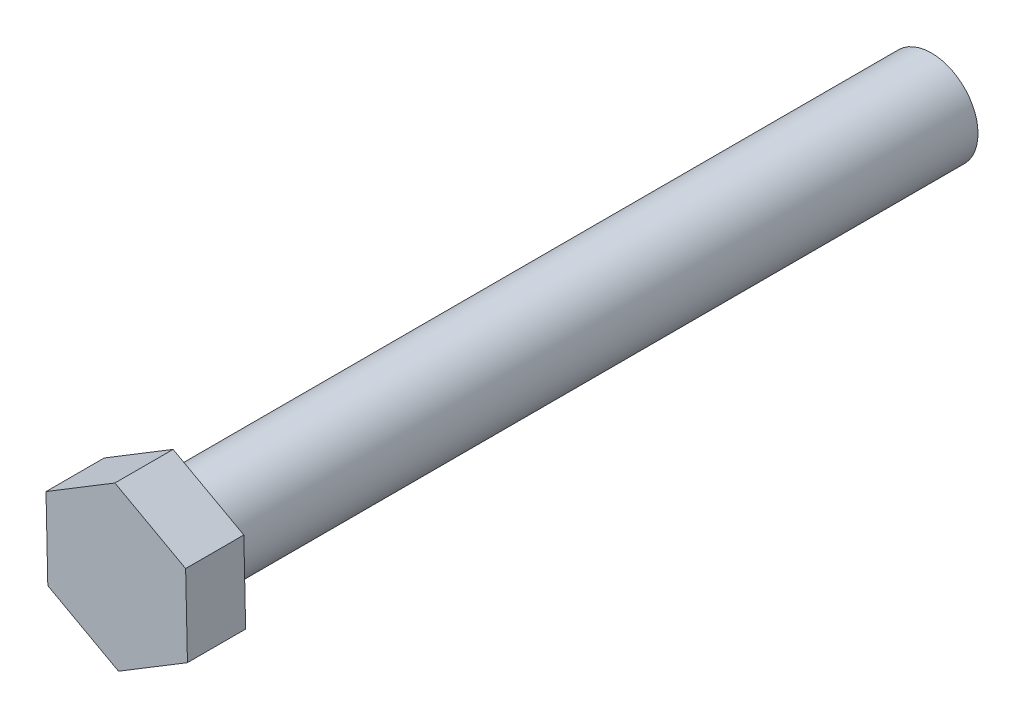
ISO-10303-21;
HEADER;
FILE_DESCRIPTION(('STEP AP214'),'2;1');
FILE_NAME('part.step','',(''),(''),'','','');
FILE_SCHEMA(('AUTOMOTIVE_DESIGN { 1 0 10303 214 1 1 1 1 }'));
ENDSEC;
DATA;
#1=APPLICATION_CONTEXT('core data for automotive mechanical design processes');
#2=APPLICATION_PROTOCOL_DEFINITION('international standard','automotive_design',2000,#1);
#3=PRODUCT_CONTEXT('',#1,'mechanical');
#4=PRODUCT('Part','Part','',(#3));
#5=PRODUCT_RELATED_PRODUCT_CATEGORY('part','',(#4));
#6=PRODUCT_DEFINITION_FORMATION('','',#4);
#7=PRODUCT_DEFINITION_CONTEXT('part definition',#1,'design');
#8=PRODUCT_DEFINITION('design','',#6,#7);
#9=PRODUCT_DEFINITION_SHAPE('','',#8);
#10=(LENGTH_UNIT() NAMED_UNIT(*) SI_UNIT(.MILLI.,.METRE.));
#11=(NAMED_UNIT(*) PLANE_ANGLE_UNIT() SI_UNIT($,.RADIAN.));
#12=(NAMED_UNIT(*) SI_UNIT($,.STERADIAN.) SOLID_ANGLE_UNIT());
#13=UNCERTAINTY_MEASURE_WITH_UNIT(LENGTH_MEASURE(1.E-05),#10,'distance_accuracy_value','');
#14=(GEOMETRIC_REPRESENTATION_CONTEXT(3) GLOBAL_UNCERTAINTY_ASSIGNED_CONTEXT((#13)) GLOBAL_UNIT_ASSIGNED_CONTEXT((#10,
#11,#12)) REPRESENTATION_CONTEXT('',''));
#15=CARTESIAN_POINT('',(0.,0.,0.));
#16=DIRECTION('',(0.,0.,1.));
#17=DIRECTION('',(1.,0.,0.));
#18=AXIS2_PLACEMENT_3D('',#15,#16,#17);
#19=CARTESIAN_POINT('',(0.,0.,65.));
#20=DIRECTION('',(0.,0.,-1.));
#21=DIRECTION('',(-1.,0.,0.));
#22=AXIS2_PLACEMENT_3D('',#19,#20,#21);
#23=CYLINDRICAL_SURFACE('',#22,4.);
#24=CARTESIAN_POINT('',(0.,0.,65.));
#25=DIRECTION('',(0.,0.,1.));
#26=DIRECTION('',(1.,0.,0.));
#27=AXIS2_PLACEMENT_3D('',#24,#25,#26);
#28=CIRCLE('',#27,4.);
#29=CARTESIAN_POINT('',(4.,0.,65.));
#30=VERTEX_POINT('',#29);
#31=EDGE_CURVE('E11',#30,#30,#28,.T.);
#32=ORIENTED_EDGE('',*,*,#31,.F.);
#33=EDGE_LOOP('',(#32));
#34=FACE_BOUND('',#33,.T.);
#35=CARTESIAN_POINT('',(0.,0.,0.));
#36=DIRECTION('',(0.,0.,1.));
#37=DIRECTION('',(1.,0.,0.));
#38=AXIS2_PLACEMENT_3D('',#35,#36,#37);
#39=CIRCLE('',#38,4.);
#40=CARTESIAN_POINT('',(4.,0.,0.));
#41=VERTEX_POINT('',#40);
#42=EDGE_CURVE('E37',#41,#41,#39,.T.);
#43=ORIENTED_EDGE('',*,*,#42,.T.);
#44=EDGE_LOOP('',(#43));
#45=FACE_BOUND('',#44,.T.);
#46=ADVANCED_FACE('F34',(#34,#45),#23,.T.);
#47=CARTESIAN_POINT('',(0.,0.,0.));
#48=DIRECTION('',(0.,0.,1.));
#49=DIRECTION('',(1.,0.,0.));
#50=AXIS2_PLACEMENT_3D('',#47,#48,#49);
#51=PLANE('',#50);
#52=ORIENTED_EDGE('',*,*,#42,.F.);
#53=EDGE_LOOP('',(#52));
#54=FACE_BOUND('',#53,.T.);
#55=ADVANCED_FACE('F142',(#54),#51,.F.);
#56=CARTESIAN_POINT('',(0.155789851531554,-6.92645143794135,70.));
#57=DIRECTION('',(-0.519347306719483,0.854563265652824,0.));
#58=DIRECTION('',(-0.854563265652824,-0.519347306719483,0.));
#59=AXIS2_PLACEMENT_3D('',#56,#57,#58);
#60=PLANE('',#59);
#61=DIRECTION('',(0.854563265652824,0.519347306719483,0.));
#62=VECTOR('',#61,1.);
#63=CARTESIAN_POINT('',(0.155789851531554,-6.92645143794135,65.));
#64=LINE('',#63,#62);
#65=CARTESIAN_POINT('',(0.155789851531554,-6.92645143794135,65.));
#66=VERTEX_POINT('',#65);
#67=CARTESIAN_POINT('',(6.07637782910224,-3.32830774989254,65.));
#68=VERTEX_POINT('',#67);
#69=EDGE_CURVE('E119',#66,#68,#64,.T.);
#70=ORIENTED_EDGE('',*,*,#69,.T.);
#71=DIRECTION('',(0.,0.,-1.));
#72=VECTOR('',#71,1.);
#73=CARTESIAN_POINT('',(6.07637782910224,-3.32830774989254,70.));
#74=LINE('',#73,#72);
#75=CARTESIAN_POINT('',(6.07637782910224,-3.32830774989254,70.));
#76=VERTEX_POINT('',#75);
#77=EDGE_CURVE('E136',#76,#68,#74,.T.);
#78=ORIENTED_EDGE('',*,*,#77,.F.);
#79=DIRECTION('',(0.854563265652824,0.519347306719483,0.));
#80=VECTOR('',#79,1.);
#81=CARTESIAN_POINT('',(0.155789851531554,-6.92645143794135,70.));
#82=LINE('',#81,#80);
#83=CARTESIAN_POINT('',(0.155789851531554,-6.92645143794135,70.));
#84=VERTEX_POINT('',#83);
#85=EDGE_CURVE('E129',#84,#76,#82,.T.);
#86=ORIENTED_EDGE('',*,*,#85,.F.);
#87=DIRECTION('',(0.,0.,-1.));
#88=VECTOR('',#87,1.);
#89=CARTESIAN_POINT('',(0.155789851531554,-6.92645143794135,70.));
#90=LINE('',#89,#88);
#91=EDGE_CURVE('E115',#84,#66,#90,.T.);
#92=ORIENTED_EDGE('',*,*,#91,.T.);
#93=EDGE_LOOP('',(#70,#78,#86,#92));
#94=FACE_BOUND('',#93,.T.);
#95=ADVANCED_FACE('F144',(#94),#60,.F.);
#96=CARTESIAN_POINT('',(6.07637782910224,-3.32830774989254,70.));
#97=DIRECTION('',(-0.999747150556077,-0.0224863281796887,0.));
#98=DIRECTION('',(0.0224863281796887,-0.999747150556077,0.));
#99=AXIS2_PLACEMENT_3D('',#96,#97,#98);
#100=PLANE('',#99);
#101=DIRECTION('',(-0.0224863281796887,0.999747150556077,0.));
#102=VECTOR('',#101,1.);
#103=CARTESIAN_POINT('',(6.07637782910224,-3.32830774989254,65.));
#104=LINE('',#103,#102);
#105=CARTESIAN_POINT('',(5.92058797757069,3.59814368804881,65.));
#106=VERTEX_POINT('',#105);
#107=EDGE_CURVE('E122',#68,#106,#104,.T.);
#108=ORIENTED_EDGE('',*,*,#107,.T.);
#109=DIRECTION('',(0.,0.,-1.));
#110=VECTOR('',#109,1.);
#111=CARTESIAN_POINT('',(5.92058797757069,3.59814368804881,70.));
#112=LINE('',#111,#110);
#113=CARTESIAN_POINT('',(5.92058797757069,3.59814368804881,70.));
#114=VERTEX_POINT('',#113);
#115=EDGE_CURVE('E133',#114,#106,#112,.T.);
#116=ORIENTED_EDGE('',*,*,#115,.F.);
#117=DIRECTION('',(-0.0224863281796887,0.999747150556077,0.));
#118=VECTOR('',#117,1.);
#119=CARTESIAN_POINT('',(6.07637782910224,-3.32830774989254,70.));
#120=LINE('',#119,#118);
#121=EDGE_CURVE('E88',#76,#114,#120,.T.);
#122=ORIENTED_EDGE('',*,*,#121,.F.);
#123=ORIENTED_EDGE('',*,*,#77,.T.);
#124=EDGE_LOOP('',(#108,#116,#122,#123));
#125=FACE_BOUND('',#124,.T.);
#126=ADVANCED_FACE('F149',(#125),#100,.F.);
#127=CARTESIAN_POINT('',(5.92058797757069,3.59814368804881,70.));
#128=DIRECTION('',(-0.480399843836594,-0.877049593832513,0.));
#129=DIRECTION('',(0.877049593832513,-0.480399843836594,0.));
#130=AXIS2_PLACEMENT_3D('',#127,#128,#129);
#131=PLANE('',#130);
#132=DIRECTION('',(-0.877049593832513,0.480399843836594,0.));
#133=VECTOR('',#132,1.);
#134=CARTESIAN_POINT('',(5.92058797757069,3.59814368804881,65.));
#135=LINE('',#134,#133);
#136=CARTESIAN_POINT('',(-0.155789851531555,6.92645143794135,65.));
#137=VERTEX_POINT('',#136);
#138=EDGE_CURVE('E124',#106,#137,#135,.T.);
#139=ORIENTED_EDGE('',*,*,#138,.T.);
#140=DIRECTION('',(0.,0.,-1.));
#141=VECTOR('',#140,1.);
#142=CARTESIAN_POINT('',(-0.155789851531555,6.92645143794135,70.));
#143=LINE('',#142,#141);
#144=CARTESIAN_POINT('',(-0.155789851531555,6.92645143794135,70.));
#145=VERTEX_POINT('',#144);
#146=EDGE_CURVE('E110',#145,#137,#143,.T.);
#147=ORIENTED_EDGE('',*,*,#146,.F.);
#148=DIRECTION('',(-0.877049593832513,0.480399843836594,0.));
#149=VECTOR('',#148,1.);
#150=CARTESIAN_POINT('',(5.92058797757069,3.59814368804881,70.));
#151=LINE('',#150,#149);
#152=EDGE_CURVE('E101',#114,#145,#151,.T.);
#153=ORIENTED_EDGE('',*,*,#152,.F.);
#154=ORIENTED_EDGE('',*,*,#115,.T.);
#155=EDGE_LOOP('',(#139,#147,#153,#154));
#156=FACE_BOUND('',#155,.T.);
#157=ADVANCED_FACE('F156',(#156),#131,.F.);
#158=CARTESIAN_POINT('',(-0.155789851531555,6.92645143794135,70.));
#159=DIRECTION('',(0.519347306719483,-0.854563265652824,0.));
#160=DIRECTION('',(0.854563265652824,0.519347306719483,0.));
#161=AXIS2_PLACEMENT_3D('',#158,#159,#160);
#162=PLANE('',#161);
#163=DIRECTION('',(-0.854563265652824,-0.519347306719483,0.));
#164=VECTOR('',#163,1.);
#165=CARTESIAN_POINT('',(-0.155789851531555,6.92645143794135,65.));
#166=LINE('',#165,#164);
#167=CARTESIAN_POINT('',(-6.07637782910224,3.32830774989254,65.));
#168=VERTEX_POINT('',#167);
#169=EDGE_CURVE('E109',#137,#168,#166,.T.);
#170=ORIENTED_EDGE('',*,*,#169,.T.);
#171=DIRECTION('',(0.,0.,-1.));
#172=VECTOR('',#171,1.);
#173=CARTESIAN_POINT('',(-6.07637782910224,3.32830774989254,70.));
#174=LINE('',#173,#172);
#175=CARTESIAN_POINT('',(-6.07637782910224,3.32830774989254,70.));
#176=VERTEX_POINT('',#175);
#177=EDGE_CURVE('E106',#176,#168,#174,.T.);
#178=ORIENTED_EDGE('',*,*,#177,.F.);
#179=DIRECTION('',(-0.854563265652824,-0.519347306719483,0.));
#180=VECTOR('',#179,1.);
#181=CARTESIAN_POINT('',(-0.155789851531555,6.92645143794135,70.));
#182=LINE('',#181,#180);
#183=EDGE_CURVE('E95',#145,#176,#182,.T.);
#184=ORIENTED_EDGE('',*,*,#183,.F.);
#185=ORIENTED_EDGE('',*,*,#146,.T.);
#186=EDGE_LOOP('',(#170,#178,#184,#185));
#187=FACE_BOUND('',#186,.T.);
#188=ADVANCED_FACE('F107',(#187),#162,.F.);
#189=CARTESIAN_POINT('',(-6.07637782910224,3.32830774989254,70.));
#190=DIRECTION('',(0.999747150556077,0.0224863281796886,0.));
#191=DIRECTION('',(-0.0224863281796886,0.999747150556077,0.));
#192=AXIS2_PLACEMENT_3D('',#189,#190,#191);
#193=PLANE('',#192);
#194=DIRECTION('',(0.0224863281796886,-0.999747150556077,0.));
#195=VECTOR('',#194,1.);
#196=CARTESIAN_POINT('',(-6.07637782910224,3.32830774989254,65.));
#197=LINE('',#196,#195);
#198=CARTESIAN_POINT('',(-5.92058797757069,-3.59814368804881,65.));
#199=VERTEX_POINT('',#198);
#200=EDGE_CURVE('E73',#168,#199,#197,.T.);
#201=ORIENTED_EDGE('',*,*,#200,.T.);
#202=DIRECTION('',(0.,0.,-1.));
#203=VECTOR('',#202,1.);
#204=CARTESIAN_POINT('',(-5.92058797757069,-3.59814368804881,70.));
#205=LINE('',#204,#203);
#206=CARTESIAN_POINT('',(-5.92058797757069,-3.59814368804881,70.));
#207=VERTEX_POINT('',#206);
#208=EDGE_CURVE('E111',#207,#199,#205,.T.);
#209=ORIENTED_EDGE('',*,*,#208,.F.);
#210=DIRECTION('',(0.0224863281796886,-0.999747150556077,0.));
#211=VECTOR('',#210,1.);
#212=CARTESIAN_POINT('',(-6.07637782910224,3.32830774989254,70.));
#213=LINE('',#212,#211);
#214=EDGE_CURVE('E99',#176,#207,#213,.T.);
#215=ORIENTED_EDGE('',*,*,#214,.F.);
#216=ORIENTED_EDGE('',*,*,#177,.T.);
#217=EDGE_LOOP('',(#201,#209,#215,#216));
#218=FACE_BOUND('',#217,.T.);
#219=ADVANCED_FACE('F113',(#218),#193,.F.);
#220=CARTESIAN_POINT('',(-5.92058797757069,-3.59814368804881,70.));
#221=DIRECTION('',(0.480399843836594,0.877049593832513,0.));
#222=DIRECTION('',(-0.877049593832513,0.480399843836595,0.));
#223=AXIS2_PLACEMENT_3D('',#220,#221,#222);
#224=PLANE('',#223);
#225=DIRECTION('',(0.877049593832513,-0.480399843836594,0.));
#226=VECTOR('',#225,1.);
#227=CARTESIAN_POINT('',(-5.92058797757069,-3.59814368804881,65.));
#228=LINE('',#227,#226);
#229=EDGE_CURVE('E79',#199,#66,#228,.T.);
#230=ORIENTED_EDGE('',*,*,#229,.T.);
#231=ORIENTED_EDGE('',*,*,#91,.F.);
#232=DIRECTION('',(0.877049593832513,-0.480399843836594,0.));
#233=VECTOR('',#232,1.);
#234=CARTESIAN_POINT('',(-5.92058797757069,-3.59814368804881,70.));
#235=LINE('',#234,#233);
#236=EDGE_CURVE('E50',#207,#84,#235,.T.);
#237=ORIENTED_EDGE('',*,*,#236,.F.);
#238=ORIENTED_EDGE('',*,*,#208,.T.);
#239=EDGE_LOOP('',(#230,#231,#237,#238));
#240=FACE_BOUND('',#239,.T.);
#241=ADVANCED_FACE('F164',(#240),#224,.F.);
#242=CARTESIAN_POINT('',(0.,0.,70.));
#243=DIRECTION('',(0.,0.,1.));
#244=DIRECTION('',(1.,0.,0.));
#245=AXIS2_PLACEMENT_3D('',#242,#243,#244);
#246=PLANE('',#245);
#247=ORIENTED_EDGE('',*,*,#85,.T.);
#248=ORIENTED_EDGE('',*,*,#121,.T.);
#249=ORIENTED_EDGE('',*,*,#152,.T.);
#250=ORIENTED_EDGE('',*,*,#183,.T.);
#251=ORIENTED_EDGE('',*,*,#214,.T.);
#252=ORIENTED_EDGE('',*,*,#236,.T.);
#253=EDGE_LOOP('',(#247,#248,#249,#250,#251,#252));
#254=FACE_BOUND('',#253,.T.);
#255=ADVANCED_FACE('F97',(#254),#246,.T.);
#256=CARTESIAN_POINT('',(0.,0.,65.));
#257=DIRECTION('',(0.,0.,1.));
#258=DIRECTION('',(1.,0.,0.));
#259=AXIS2_PLACEMENT_3D('',#256,#257,#258);
#260=PLANE('',#259);
#261=ORIENTED_EDGE('',*,*,#31,.T.);
#262=EDGE_LOOP('',(#261));
#263=FACE_BOUND('',#262,.T.);
#264=ORIENTED_EDGE('',*,*,#69,.F.);
#265=ORIENTED_EDGE('',*,*,#229,.F.);
#266=ORIENTED_EDGE('',*,*,#200,.F.);
#267=ORIENTED_EDGE('',*,*,#169,.F.);
#268=ORIENTED_EDGE('',*,*,#138,.F.);
#269=ORIENTED_EDGE('',*,*,#107,.F.);
#270=EDGE_LOOP('',(#264,#265,#266,#267,#268,#269));
#271=FACE_BOUND('',#270,.T.);
#272=ADVANCED_FACE('F167',(#263,#271),#260,.F.);
#273=CLOSED_SHELL('',(#46,#55,#95,#126,#157,#188,#219,#241,#255,#272));
#274=MANIFOLD_SOLID_BREP('B2',#273);
#275=ADVANCED_BREP_SHAPE_REPRESENTATION('',(#18,#274),#14);
#276=SHAPE_DEFINITION_REPRESENTATION(#9,#275);
ENDSEC;
END-ISO-10303-21;
